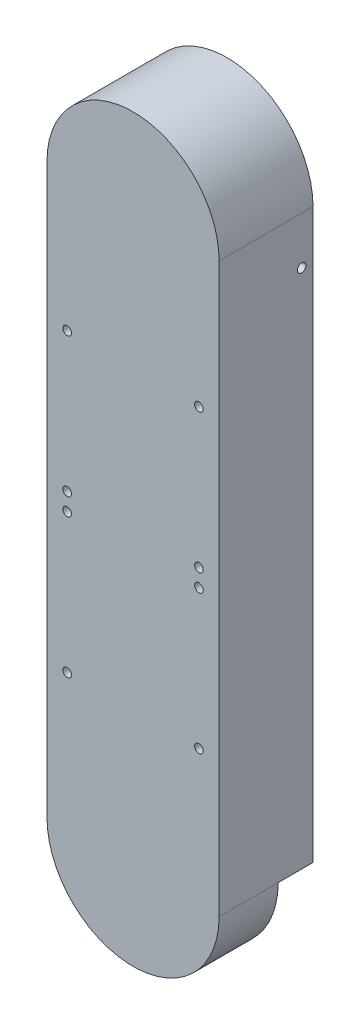
ISO-10303-21;
HEADER;
FILE_DESCRIPTION(('STEP AP214'),'2;1');
FILE_NAME('part.step','',(''),(''),'','','');
FILE_SCHEMA(('AUTOMOTIVE_DESIGN { 1 0 10303 214 1 1 1 1 }'));
ENDSEC;
DATA;
#1=APPLICATION_CONTEXT('core data for automotive mechanical design processes');
#2=APPLICATION_PROTOCOL_DEFINITION('international standard','automotive_design',2000,#1);
#3=PRODUCT_CONTEXT('',#1,'mechanical');
#4=PRODUCT('Part','Part','',(#3));
#5=PRODUCT_RELATED_PRODUCT_CATEGORY('part','',(#4));
#6=PRODUCT_DEFINITION_FORMATION('','',#4);
#7=PRODUCT_DEFINITION_CONTEXT('part definition',#1,'design');
#8=PRODUCT_DEFINITION('design','',#6,#7);
#9=PRODUCT_DEFINITION_SHAPE('','',#8);
#10=(LENGTH_UNIT() NAMED_UNIT(*) SI_UNIT(.MILLI.,.METRE.));
#11=(NAMED_UNIT(*) PLANE_ANGLE_UNIT() SI_UNIT($,.RADIAN.));
#12=(NAMED_UNIT(*) SI_UNIT($,.STERADIAN.) SOLID_ANGLE_UNIT());
#13=UNCERTAINTY_MEASURE_WITH_UNIT(LENGTH_MEASURE(1.E-05),#10,'distance_accuracy_value','');
#14=(GEOMETRIC_REPRESENTATION_CONTEXT(3) GLOBAL_UNCERTAINTY_ASSIGNED_CONTEXT((#13)) GLOBAL_UNIT_ASSIGNED_CONTEXT((#10,
#11,#12)) REPRESENTATION_CONTEXT('',''));
#15=CARTESIAN_POINT('',(0.,0.,0.));
#16=DIRECTION('',(0.,0.,1.));
#17=DIRECTION('',(1.,0.,0.));
#18=AXIS2_PLACEMENT_3D('',#15,#16,#17);
#19=CARTESIAN_POINT('',(35.,-230.98,14.18));
#20=DIRECTION('',(0.,1.,0.));
#21=DIRECTION('',(0.,0.,1.));
#22=AXIS2_PLACEMENT_3D('',#19,#20,#21);
#23=PLANE('',#22);
#24=DIRECTION('',(0.,0.,-1.));
#25=VECTOR('',#24,1.);
#26=CARTESIAN_POINT('',(25.,-230.98,105.710678118655));
#27=LINE('',#26,#25);
#28=CARTESIAN_POINT('',(25.,-230.98,35.));
#29=VERTEX_POINT('',#28);
#30=CARTESIAN_POINT('',(25.,-230.98,14.18));
#31=VERTEX_POINT('',#30);
#32=EDGE_CURVE('E49',#29,#31,#27,.T.);
#33=ORIENTED_EDGE('',*,*,#32,.F.);
#34=DIRECTION('',(1.,0.,0.));
#35=VECTOR('',#34,1.);
#36=CARTESIAN_POINT('',(-30.,-230.98,35.));
#37=LINE('',#36,#35);
#38=CARTESIAN_POINT('',(30.,-230.98,35.));
#39=VERTEX_POINT('',#38);
#40=EDGE_CURVE('E175',#29,#39,#37,.T.);
#41=ORIENTED_EDGE('',*,*,#40,.T.);
#42=DIRECTION('',(0.,0.,-1.));
#43=VECTOR('',#42,1.);
#44=CARTESIAN_POINT('',(30.,-230.98,35.));
#45=LINE('',#44,#43);
#46=CARTESIAN_POINT('',(30.,-230.98,14.18));
#47=VERTEX_POINT('',#46);
#48=EDGE_CURVE('E155',#39,#47,#45,.T.);
#49=ORIENTED_EDGE('',*,*,#48,.T.);
#50=DIRECTION('',(-1.,0.,0.));
#51=VECTOR('',#50,1.);
#52=CARTESIAN_POINT('',(35.,-230.98,14.18));
#53=LINE('',#52,#51);
#54=EDGE_CURVE('E136',#47,#31,#53,.T.);
#55=ORIENTED_EDGE('',*,*,#54,.T.);
#56=EDGE_LOOP('',(#33,#41,#49,#55));
#57=FACE_BOUND('',#56,.T.);
#58=ADVANCED_FACE('F34',(#57),#23,.T.);
#59=CARTESIAN_POINT('',(0.,-230.98,0.));
#60=DIRECTION('',(0.,-1.,0.));
#61=DIRECTION('',(0.,0.,-1.));
#62=AXIS2_PLACEMENT_3D('',#59,#60,#61);
#63=PLANE('',#62);
#64=DIRECTION('',(0.,0.,1.));
#65=VECTOR('',#64,1.);
#66=CARTESIAN_POINT('',(35.,-230.98,0.));
#67=LINE('',#66,#65);
#68=CARTESIAN_POINT('',(35.,-230.98,0.));
#69=VERTEX_POINT('',#68);
#70=CARTESIAN_POINT('',(35.,-230.98,14.18));
#71=VERTEX_POINT('',#70);
#72=EDGE_CURVE('E162',#69,#71,#67,.T.);
#73=ORIENTED_EDGE('',*,*,#72,.T.);
#74=EDGE_CURVE('E139',#71,#47,#53,.T.);
#75=ORIENTED_EDGE('',*,*,#74,.T.);
#76=CARTESIAN_POINT('',(30.,-230.98,0.));
#77=VERTEX_POINT('',#76);
#78=EDGE_CURVE('E150',#47,#77,#45,.T.);
#79=ORIENTED_EDGE('',*,*,#78,.T.);
#80=DIRECTION('',(1.,0.,0.));
#81=VECTOR('',#80,1.);
#82=CARTESIAN_POINT('',(30.,-230.98,0.));
#83=LINE('',#82,#81);
#84=EDGE_CURVE('E159',#77,#69,#83,.T.);
#85=ORIENTED_EDGE('',*,*,#84,.T.);
#86=EDGE_LOOP('',(#73,#75,#79,#85));
#87=FACE_BOUND('',#86,.T.);
#88=ADVANCED_FACE('F274',(#87),#63,.T.);
#89=DIRECTION('',(0.,0.,1.));
#90=VECTOR('',#89,1.);
#91=CARTESIAN_POINT('',(-30.,-230.98,0.));
#92=LINE('',#91,#90);
#93=CARTESIAN_POINT('',(-30.,-230.98,0.));
#94=VERTEX_POINT('',#93);
#95=CARTESIAN_POINT('',(-30.,-230.98,14.18));
#96=VERTEX_POINT('',#95);
#97=EDGE_CURVE('E172',#94,#96,#92,.T.);
#98=ORIENTED_EDGE('',*,*,#97,.T.);
#99=DIRECTION('',(-1.,0.,0.));
#100=VECTOR('',#99,1.);
#101=CARTESIAN_POINT('',(0.,-230.98,14.18));
#102=LINE('',#101,#100);
#103=CARTESIAN_POINT('',(-35.,-230.98,14.18));
#104=VERTEX_POINT('',#103);
#105=EDGE_CURVE('E42',#96,#104,#102,.T.);
#106=ORIENTED_EDGE('',*,*,#105,.T.);
#107=DIRECTION('',(0.,0.,-1.));
#108=VECTOR('',#107,1.);
#109=CARTESIAN_POINT('',(-35.,-230.98,38.18));
#110=LINE('',#109,#108);
#111=CARTESIAN_POINT('',(-35.,-230.98,0.));
#112=VERTEX_POINT('',#111);
#113=EDGE_CURVE('E164',#104,#112,#110,.T.);
#114=ORIENTED_EDGE('',*,*,#113,.T.);
#115=DIRECTION('',(1.,0.,0.));
#116=VECTOR('',#115,1.);
#117=CARTESIAN_POINT('',(-35.,-230.98,0.));
#118=LINE('',#117,#116);
#119=EDGE_CURVE('E168',#112,#94,#118,.T.);
#120=ORIENTED_EDGE('',*,*,#119,.T.);
#121=EDGE_LOOP('',(#98,#106,#114,#120));
#122=FACE_BOUND('',#121,.T.);
#123=ADVANCED_FACE('F259',(#122),#63,.T.);
#124=CARTESIAN_POINT('',(0.,0.,35.));
#125=DIRECTION('',(0.,0.,-1.));
#126=DIRECTION('',(-1.,0.,0.));
#127=AXIS2_PLACEMENT_3D('',#124,#125,#126);
#128=CYLINDRICAL_SURFACE('',#127,35.);
#129=CARTESIAN_POINT('',(0.,0.,0.));
#130=DIRECTION('',(0.,0.,1.));
#131=DIRECTION('',(1.,0.,0.));
#132=AXIS2_PLACEMENT_3D('',#129,#130,#131);
#133=CIRCLE('',#132,35.);
#134=CARTESIAN_POINT('',(35.,0.,0.));
#135=VERTEX_POINT('',#134);
#136=CARTESIAN_POINT('',(-35.,0.,0.));
#137=VERTEX_POINT('',#136);
#138=EDGE_CURVE('E222',#135,#137,#133,.T.);
#139=ORIENTED_EDGE('',*,*,#138,.T.);
#140=DIRECTION('',(0.,0.,-1.));
#141=VECTOR('',#140,1.);
#142=CARTESIAN_POINT('',(-35.,0.,35.));
#143=LINE('',#142,#141);
#144=CARTESIAN_POINT('',(-35.,0.,38.18));
#145=VERTEX_POINT('',#144);
#146=EDGE_CURVE('E255',#145,#137,#143,.T.);
#147=ORIENTED_EDGE('',*,*,#146,.F.);
#148=CARTESIAN_POINT('',(0.,0.,38.18));
#149=DIRECTION('',(0.,0.,1.));
#150=DIRECTION('',(1.,0.,0.));
#151=AXIS2_PLACEMENT_3D('',#148,#149,#150);
#152=CIRCLE('',#151,35.);
#153=CARTESIAN_POINT('',(35.,0.,38.18));
#154=VERTEX_POINT('',#153);
#155=EDGE_CURVE('E213',#154,#145,#152,.T.);
#156=ORIENTED_EDGE('',*,*,#155,.F.);
#157=DIRECTION('',(0.,0.,-1.));
#158=VECTOR('',#157,1.);
#159=CARTESIAN_POINT('',(35.,0.,35.));
#160=LINE('',#159,#158);
#161=EDGE_CURVE('E233',#154,#135,#160,.T.);
#162=ORIENTED_EDGE('',*,*,#161,.T.);
#163=EDGE_LOOP('',(#139,#147,#156,#162));
#164=FACE_BOUND('',#163,.T.);
#165=ADVANCED_FACE('F36',(#164),#128,.T.);
#166=CARTESIAN_POINT('',(-35.,0.,35.));
#167=DIRECTION('',(1.,0.,0.));
#168=DIRECTION('',(0.,1.,0.));
#169=AXIS2_PLACEMENT_3D('',#166,#167,#168);
#170=PLANE('',#169);
#171=CARTESIAN_POINT('',(-35.,-19.28,4.61));
#172=DIRECTION('',(1.,0.,0.));
#173=DIRECTION('',(0.,1.,0.));
#174=AXIS2_PLACEMENT_3D('',#171,#172,#173);
#175=CIRCLE('',#174,1.75);
#176=CARTESIAN_POINT('',(-35.,-17.53,4.61));
#177=VERTEX_POINT('',#176);
#178=EDGE_CURVE('E178',#177,#177,#175,.T.);
#179=ORIENTED_EDGE('',*,*,#178,.T.);
#180=EDGE_LOOP('',(#179));
#181=FACE_BOUND('',#180,.T.);
#182=DIRECTION('',(0.,-1.,0.));
#183=VECTOR('',#182,1.);
#184=CARTESIAN_POINT('',(-35.,0.,0.));
#185=LINE('',#184,#183);
#186=EDGE_CURVE('E236',#137,#112,#185,.T.);
#187=ORIENTED_EDGE('',*,*,#186,.T.);
#188=ORIENTED_EDGE('',*,*,#113,.F.);
#189=CARTESIAN_POINT('',(-35.,-230.98,38.18));
#190=VERTEX_POINT('',#189);
#191=EDGE_CURVE('E165',#190,#104,#110,.T.);
#192=ORIENTED_EDGE('',*,*,#191,.F.);
#193=DIRECTION('',(0.,-1.,0.));
#194=VECTOR('',#193,1.);
#195=CARTESIAN_POINT('',(-35.,0.,38.18));
#196=LINE('',#195,#194);
#197=EDGE_CURVE('E216',#145,#190,#196,.T.);
#198=ORIENTED_EDGE('',*,*,#197,.F.);
#199=ORIENTED_EDGE('',*,*,#146,.T.);
#200=EDGE_LOOP('',(#187,#188,#192,#198,#199));
#201=FACE_BOUND('',#200,.T.);
#202=ADVANCED_FACE('F262',(#181,#201),#170,.F.);
#203=CARTESIAN_POINT('',(-30.,0.,35.));
#204=DIRECTION('',(-1.,0.,0.));
#205=DIRECTION('',(0.,-1.,0.));
#206=AXIS2_PLACEMENT_3D('',#203,#204,#205);
#207=PLANE('',#206);
#208=CARTESIAN_POINT('',(-30.,-19.28,4.61));
#209=DIRECTION('',(-1.,0.,0.));
#210=DIRECTION('',(0.,-1.,0.));
#211=AXIS2_PLACEMENT_3D('',#208,#209,#210);
#212=CIRCLE('',#211,1.75);
#213=CARTESIAN_POINT('',(-30.,-21.03,4.61));
#214=VERTEX_POINT('',#213);
#215=EDGE_CURVE('E186',#214,#214,#212,.T.);
#216=ORIENTED_EDGE('',*,*,#215,.T.);
#217=EDGE_LOOP('',(#216));
#218=FACE_BOUND('',#217,.T.);
#219=DIRECTION('',(0.,1.,0.));
#220=VECTOR('',#219,1.);
#221=CARTESIAN_POINT('',(-30.,0.,0.));
#222=LINE('',#221,#220);
#223=CARTESIAN_POINT('',(-30.,0.,0.));
#224=VERTEX_POINT('',#223);
#225=EDGE_CURVE('E239',#94,#224,#222,.T.);
#226=ORIENTED_EDGE('',*,*,#225,.T.);
#227=DIRECTION('',(0.,0.,-1.));
#228=VECTOR('',#227,1.);
#229=CARTESIAN_POINT('',(-30.,0.,35.));
#230=LINE('',#229,#228);
#231=CARTESIAN_POINT('',(-30.,0.,35.));
#232=VERTEX_POINT('',#231);
#233=EDGE_CURVE('E252',#232,#224,#230,.T.);
#234=ORIENTED_EDGE('',*,*,#233,.F.);
#235=DIRECTION('',(0.,1.,0.));
#236=VECTOR('',#235,1.);
#237=CARTESIAN_POINT('',(-30.,0.,35.));
#238=LINE('',#237,#236);
#239=CARTESIAN_POINT('',(-30.,-230.98,35.));
#240=VERTEX_POINT('',#239);
#241=EDGE_CURVE('E223',#240,#232,#238,.T.);
#242=ORIENTED_EDGE('',*,*,#241,.F.);
#243=EDGE_CURVE('E171',#96,#240,#92,.T.);
#244=ORIENTED_EDGE('',*,*,#243,.F.);
#245=ORIENTED_EDGE('',*,*,#97,.F.);
#246=EDGE_LOOP('',(#226,#234,#242,#244,#245));
#247=FACE_BOUND('',#246,.T.);
#248=ADVANCED_FACE('F287',(#218,#247),#207,.F.);
#249=CARTESIAN_POINT('',(0.,0.,35.));
#250=DIRECTION('',(0.,0.,-1.));
#251=DIRECTION('',(-1.,0.,0.));
#252=AXIS2_PLACEMENT_3D('',#249,#250,#251);
#253=CYLINDRICAL_SURFACE('',#252,30.);
#254=CARTESIAN_POINT('',(0.,0.,0.));
#255=DIRECTION('',(0.,0.,-1.));
#256=DIRECTION('',(1.,0.,0.));
#257=AXIS2_PLACEMENT_3D('',#254,#255,#256);
#258=CIRCLE('',#257,30.);
#259=CARTESIAN_POINT('',(30.,0.,0.));
#260=VERTEX_POINT('',#259);
#261=EDGE_CURVE('E241',#224,#260,#258,.T.);
#262=ORIENTED_EDGE('',*,*,#261,.T.);
#263=DIRECTION('',(0.,0.,-1.));
#264=VECTOR('',#263,1.);
#265=CARTESIAN_POINT('',(30.,0.,35.));
#266=LINE('',#265,#264);
#267=CARTESIAN_POINT('',(30.,0.,35.));
#268=VERTEX_POINT('',#267);
#269=EDGE_CURVE('E249',#268,#260,#266,.T.);
#270=ORIENTED_EDGE('',*,*,#269,.F.);
#271=CARTESIAN_POINT('',(0.,0.,35.));
#272=DIRECTION('',(0.,0.,-1.));
#273=DIRECTION('',(1.,0.,0.));
#274=AXIS2_PLACEMENT_3D('',#271,#272,#273);
#275=CIRCLE('',#274,30.);
#276=EDGE_CURVE('E226',#232,#268,#275,.T.);
#277=ORIENTED_EDGE('',*,*,#276,.F.);
#278=ORIENTED_EDGE('',*,*,#233,.T.);
#279=EDGE_LOOP('',(#262,#270,#277,#278));
#280=FACE_BOUND('',#279,.T.);
#281=ADVANCED_FACE('F454',(#280),#253,.F.);
#282=CARTESIAN_POINT('',(30.,0.,35.));
#283=DIRECTION('',(1.,0.,0.));
#284=DIRECTION('',(0.,1.,0.));
#285=AXIS2_PLACEMENT_3D('',#282,#283,#284);
#286=PLANE('',#285);
#287=CARTESIAN_POINT('',(30.,-19.28,4.61));
#288=DIRECTION('',(1.,0.,0.));
#289=DIRECTION('',(0.,1.,0.));
#290=AXIS2_PLACEMENT_3D('',#287,#288,#289);
#291=CIRCLE('',#290,1.75);
#292=CARTESIAN_POINT('',(30.,-17.53,4.61));
#293=VERTEX_POINT('',#292);
#294=EDGE_CURVE('E181',#293,#293,#291,.T.);
#295=ORIENTED_EDGE('',*,*,#294,.T.);
#296=EDGE_LOOP('',(#295));
#297=FACE_BOUND('',#296,.T.);
#298=DIRECTION('',(0.,-1.,0.));
#299=VECTOR('',#298,1.);
#300=CARTESIAN_POINT('',(30.,0.,0.));
#301=LINE('',#300,#299);
#302=EDGE_CURVE('E243',#260,#77,#301,.T.);
#303=ORIENTED_EDGE('',*,*,#302,.T.);
#304=ORIENTED_EDGE('',*,*,#78,.F.);
#305=ORIENTED_EDGE('',*,*,#48,.F.);
#306=DIRECTION('',(0.,-1.,0.));
#307=VECTOR('',#306,1.);
#308=CARTESIAN_POINT('',(30.,0.,35.));
#309=LINE('',#308,#307);
#310=EDGE_CURVE('E230',#268,#39,#309,.T.);
#311=ORIENTED_EDGE('',*,*,#310,.F.);
#312=ORIENTED_EDGE('',*,*,#269,.T.);
#313=EDGE_LOOP('',(#303,#304,#305,#311,#312));
#314=FACE_BOUND('',#313,.T.);
#315=ADVANCED_FACE('F271',(#297,#314),#286,.F.);
#316=CARTESIAN_POINT('',(35.,0.,35.));
#317=DIRECTION('',(-1.,0.,0.));
#318=DIRECTION('',(0.,-1.,0.));
#319=AXIS2_PLACEMENT_3D('',#316,#317,#318);
#320=PLANE('',#319);
#321=CARTESIAN_POINT('',(35.,-19.28,4.61));
#322=DIRECTION('',(1.,0.,0.));
#323=DIRECTION('',(0.,1.,0.));
#324=AXIS2_PLACEMENT_3D('',#321,#322,#323);
#325=CIRCLE('',#324,1.75);
#326=CARTESIAN_POINT('',(35.,-17.53,4.61));
#327=VERTEX_POINT('',#326);
#328=EDGE_CURVE('E177',#327,#327,#325,.T.);
#329=ORIENTED_EDGE('',*,*,#328,.F.);
#330=EDGE_LOOP('',(#329));
#331=FACE_BOUND('',#330,.T.);
#332=DIRECTION('',(0.,1.,0.));
#333=VECTOR('',#332,1.);
#334=CARTESIAN_POINT('',(35.,0.,0.));
#335=LINE('',#334,#333);
#336=EDGE_CURVE('E227',#69,#135,#335,.T.);
#337=ORIENTED_EDGE('',*,*,#336,.T.);
#338=ORIENTED_EDGE('',*,*,#161,.F.);
#339=DIRECTION('',(0.,1.,0.));
#340=VECTOR('',#339,1.);
#341=CARTESIAN_POINT('',(35.,-115.49,38.18));
#342=LINE('',#341,#340);
#343=CARTESIAN_POINT('',(35.,-230.98,38.18));
#344=VERTEX_POINT('',#343);
#345=EDGE_CURVE('E219',#344,#154,#342,.T.);
#346=ORIENTED_EDGE('',*,*,#345,.F.);
#347=DIRECTION('',(0.,0.,1.));
#348=VECTOR('',#347,1.);
#349=CARTESIAN_POINT('',(35.,-230.98,14.18));
#350=LINE('',#349,#348);
#351=EDGE_CURVE('E144',#71,#344,#350,.T.);
#352=ORIENTED_EDGE('',*,*,#351,.F.);
#353=ORIENTED_EDGE('',*,*,#72,.F.);
#354=EDGE_LOOP('',(#337,#338,#346,#352,#353));
#355=FACE_BOUND('',#354,.T.);
#356=ADVANCED_FACE('F278',(#331,#355),#320,.F.);
#357=CARTESIAN_POINT('',(0.,0.,0.));
#358=DIRECTION('',(0.,0.,1.));
#359=DIRECTION('',(1.,0.,0.));
#360=AXIS2_PLACEMENT_3D('',#357,#358,#359);
#361=PLANE('',#360);
#362=ORIENTED_EDGE('',*,*,#138,.F.);
#363=ORIENTED_EDGE('',*,*,#336,.F.);
#364=ORIENTED_EDGE('',*,*,#84,.F.);
#365=ORIENTED_EDGE('',*,*,#302,.F.);
#366=ORIENTED_EDGE('',*,*,#261,.F.);
#367=ORIENTED_EDGE('',*,*,#225,.F.);
#368=ORIENTED_EDGE('',*,*,#119,.F.);
#369=ORIENTED_EDGE('',*,*,#186,.F.);
#370=EDGE_LOOP('',(#362,#363,#364,#365,#366,#367,#368,#369));
#371=FACE_BOUND('',#370,.T.);
#372=ADVANCED_FACE('F284',(#371),#361,.F.);
#373=CARTESIAN_POINT('',(0.,0.,35.));
#374=DIRECTION('',(0.,0.,1.));
#375=DIRECTION('',(1.,0.,0.));
#376=AXIS2_PLACEMENT_3D('',#373,#374,#375);
#377=PLANE('',#376);
#378=CARTESIAN_POINT('',(-26.795,-175.86,35.));
#379=DIRECTION('',(0.,0.,1.));
#380=DIRECTION('',(1.,0.,0.));
#381=AXIS2_PLACEMENT_3D('',#378,#379,#380);
#382=CIRCLE('',#381,1.75);
#383=CARTESIAN_POINT('',(-25.045,-175.86,35.));
#384=VERTEX_POINT('',#383);
#385=EDGE_CURVE('E304',#384,#384,#382,.T.);
#386=ORIENTED_EDGE('',*,*,#385,.T.);
#387=EDGE_LOOP('',(#386));
#388=FACE_BOUND('',#387,.T.);
#389=CARTESIAN_POINT('',(26.795,-175.86,35.));
#390=DIRECTION('',(0.,0.,1.));
#391=DIRECTION('',(1.,0.,0.));
#392=AXIS2_PLACEMENT_3D('',#389,#390,#391);
#393=CIRCLE('',#392,1.75);
#394=CARTESIAN_POINT('',(28.545,-175.86,35.));
#395=VERTEX_POINT('',#394);
#396=EDGE_CURVE('E309',#395,#395,#393,.T.);
#397=ORIENTED_EDGE('',*,*,#396,.T.);
#398=EDGE_LOOP('',(#397));
#399=FACE_BOUND('',#398,.T.);
#400=CARTESIAN_POINT('',(26.795,-119.23,35.));
#401=DIRECTION('',(0.,0.,1.));
#402=DIRECTION('',(1.,0.,0.));
#403=AXIS2_PLACEMENT_3D('',#400,#401,#402);
#404=CIRCLE('',#403,1.75);
#405=CARTESIAN_POINT('',(28.545,-119.23,35.));
#406=VERTEX_POINT('',#405);
#407=EDGE_CURVE('E291',#406,#406,#404,.T.);
#408=ORIENTED_EDGE('',*,*,#407,.T.);
#409=EDGE_LOOP('',(#408));
#410=FACE_BOUND('',#409,.T.);
#411=CARTESIAN_POINT('',(-26.795,-119.23,35.));
#412=DIRECTION('',(0.,0.,1.));
#413=DIRECTION('',(1.,0.,0.));
#414=AXIS2_PLACEMENT_3D('',#411,#412,#413);
#415=CIRCLE('',#414,1.75);
#416=CARTESIAN_POINT('',(-25.045,-119.23,35.));
#417=VERTEX_POINT('',#416);
#418=EDGE_CURVE('E294',#417,#417,#415,.T.);
#419=ORIENTED_EDGE('',*,*,#418,.T.);
#420=EDGE_LOOP('',(#419));
#421=FACE_BOUND('',#420,.T.);
#422=CARTESIAN_POINT('',(-26.795,-55.49,35.));
#423=DIRECTION('',(0.,0.,1.));
#424=DIRECTION('',(1.,0.,0.));
#425=AXIS2_PLACEMENT_3D('',#422,#423,#424);
#426=CIRCLE('',#425,1.75);
#427=CARTESIAN_POINT('',(-25.045,-55.49,35.));
#428=VERTEX_POINT('',#427);
#429=EDGE_CURVE('E198',#428,#428,#426,.T.);
#430=ORIENTED_EDGE('',*,*,#429,.T.);
#431=EDGE_LOOP('',(#430));
#432=FACE_BOUND('',#431,.T.);
#433=CARTESIAN_POINT('',(26.795,-55.49,35.));
#434=DIRECTION('',(0.,0.,1.));
#435=DIRECTION('',(1.,0.,0.));
#436=AXIS2_PLACEMENT_3D('',#433,#434,#435);
#437=CIRCLE('',#436,1.75);
#438=CARTESIAN_POINT('',(28.545,-55.49,35.));
#439=VERTEX_POINT('',#438);
#440=EDGE_CURVE('E193',#439,#439,#437,.T.);
#441=ORIENTED_EDGE('',*,*,#440,.T.);
#442=EDGE_LOOP('',(#441));
#443=FACE_BOUND('',#442,.T.);
#444=CARTESIAN_POINT('',(26.795,-112.09,35.));
#445=DIRECTION('',(0.,0.,1.));
#446=DIRECTION('',(1.,0.,0.));
#447=AXIS2_PLACEMENT_3D('',#444,#445,#446);
#448=CIRCLE('',#447,1.75);
#449=CARTESIAN_POINT('',(28.545,-112.09,35.));
#450=VERTEX_POINT('',#449);
#451=EDGE_CURVE('E210',#450,#450,#448,.T.);
#452=ORIENTED_EDGE('',*,*,#451,.T.);
#453=EDGE_LOOP('',(#452));
#454=FACE_BOUND('',#453,.T.);
#455=CARTESIAN_POINT('',(-26.795,-112.09,35.));
#456=DIRECTION('',(0.,0.,1.));
#457=DIRECTION('',(1.,0.,0.));
#458=AXIS2_PLACEMENT_3D('',#455,#456,#457);
#459=CIRCLE('',#458,1.75);
#460=CARTESIAN_POINT('',(-25.045,-112.09,35.));
#461=VERTEX_POINT('',#460);
#462=EDGE_CURVE('E205',#461,#461,#459,.T.);
#463=ORIENTED_EDGE('',*,*,#462,.T.);
#464=EDGE_LOOP('',(#463));
#465=FACE_BOUND('',#464,.T.);
#466=ORIENTED_EDGE('',*,*,#40,.F.);
#467=CARTESIAN_POINT('',(0.,-230.98,35.));
#468=DIRECTION('',(0.,0.,1.));
#469=DIRECTION('',(1.,0.,0.));
#470=AXIS2_PLACEMENT_3D('',#467,#468,#469);
#471=CIRCLE('',#470,25.);
#472=CARTESIAN_POINT('',(-25.,-230.98,35.));
#473=VERTEX_POINT('',#472);
#474=EDGE_CURVE('E131',#29,#473,#471,.F.);
#475=ORIENTED_EDGE('',*,*,#474,.T.);
#476=EDGE_CURVE('E130',#240,#473,#37,.T.);
#477=ORIENTED_EDGE('',*,*,#476,.F.);
#478=ORIENTED_EDGE('',*,*,#241,.T.);
#479=ORIENTED_EDGE('',*,*,#276,.T.);
#480=ORIENTED_EDGE('',*,*,#310,.T.);
#481=EDGE_LOOP('',(#466,#475,#477,#478,#479,#480));
#482=FACE_BOUND('',#481,.T.);
#483=ADVANCED_FACE('F290',(#388,#399,#410,#421,#432,#443,#454,#465,#482),#377,.F.);
#484=CARTESIAN_POINT('',(0.,0.,38.18));
#485=DIRECTION('',(0.,0.,1.));
#486=DIRECTION('',(1.,0.,0.));
#487=AXIS2_PLACEMENT_3D('',#484,#485,#486);
#488=PLANE('',#487);
#489=CARTESIAN_POINT('',(-26.795,-175.86,38.18));
#490=DIRECTION('',(0.,0.,1.));
#491=DIRECTION('',(1.,0.,0.));
#492=AXIS2_PLACEMENT_3D('',#489,#490,#491);
#493=CIRCLE('',#492,1.75);
#494=CARTESIAN_POINT('',(-25.045,-175.86,38.18));
#495=VERTEX_POINT('',#494);
#496=EDGE_CURVE('E312',#495,#495,#493,.T.);
#497=ORIENTED_EDGE('',*,*,#496,.F.);
#498=EDGE_LOOP('',(#497));
#499=FACE_BOUND('',#498,.T.);
#500=CARTESIAN_POINT('',(26.795,-175.86,38.18));
#501=DIRECTION('',(0.,0.,1.));
#502=DIRECTION('',(1.,0.,0.));
#503=AXIS2_PLACEMENT_3D('',#500,#501,#502);
#504=CIRCLE('',#503,1.75);
#505=CARTESIAN_POINT('',(28.545,-175.86,38.18));
#506=VERTEX_POINT('',#505);
#507=EDGE_CURVE('E313',#506,#506,#504,.T.);
#508=ORIENTED_EDGE('',*,*,#507,.F.);
#509=EDGE_LOOP('',(#508));
#510=FACE_BOUND('',#509,.T.);
#511=CARTESIAN_POINT('',(26.795,-119.23,38.18));
#512=DIRECTION('',(0.,0.,1.));
#513=DIRECTION('',(1.,0.,0.));
#514=AXIS2_PLACEMENT_3D('',#511,#512,#513);
#515=CIRCLE('',#514,1.75);
#516=CARTESIAN_POINT('',(28.545,-119.23,38.18));
#517=VERTEX_POINT('',#516);
#518=EDGE_CURVE('E300',#517,#517,#515,.T.);
#519=ORIENTED_EDGE('',*,*,#518,.F.);
#520=EDGE_LOOP('',(#519));
#521=FACE_BOUND('',#520,.T.);
#522=CARTESIAN_POINT('',(-26.795,-119.23,38.18));
#523=DIRECTION('',(0.,0.,1.));
#524=DIRECTION('',(1.,0.,0.));
#525=AXIS2_PLACEMENT_3D('',#522,#523,#524);
#526=CIRCLE('',#525,1.75);
#527=CARTESIAN_POINT('',(-25.045,-119.23,38.18));
#528=VERTEX_POINT('',#527);
#529=EDGE_CURVE('E301',#528,#528,#526,.T.);
#530=ORIENTED_EDGE('',*,*,#529,.F.);
#531=EDGE_LOOP('',(#530));
#532=FACE_BOUND('',#531,.T.);
#533=CARTESIAN_POINT('',(-26.795,-55.49,38.18));
#534=DIRECTION('',(0.,0.,-1.));
#535=DIRECTION('',(-1.,0.,0.));
#536=AXIS2_PLACEMENT_3D('',#533,#534,#535);
#537=CIRCLE('',#536,1.75);
#538=CARTESIAN_POINT('',(-28.545,-55.49,38.18));
#539=VERTEX_POINT('',#538);
#540=EDGE_CURVE('E190',#539,#539,#537,.T.);
#541=ORIENTED_EDGE('',*,*,#540,.T.);
#542=EDGE_LOOP('',(#541));
#543=FACE_BOUND('',#542,.T.);
#544=CARTESIAN_POINT('',(26.795,-55.49,38.18));
#545=DIRECTION('',(0.,0.,-1.));
#546=DIRECTION('',(-1.,0.,0.));
#547=AXIS2_PLACEMENT_3D('',#544,#545,#546);
#548=CIRCLE('',#547,1.75);
#549=CARTESIAN_POINT('',(25.045,-55.49,38.18));
#550=VERTEX_POINT('',#549);
#551=EDGE_CURVE('E189',#550,#550,#548,.T.);
#552=ORIENTED_EDGE('',*,*,#551,.T.);
#553=EDGE_LOOP('',(#552));
#554=FACE_BOUND('',#553,.T.);
#555=CARTESIAN_POINT('',(26.795,-112.09,38.18));
#556=DIRECTION('',(0.,0.,-1.));
#557=DIRECTION('',(-1.,0.,0.));
#558=AXIS2_PLACEMENT_3D('',#555,#556,#557);
#559=CIRCLE('',#558,1.75);
#560=CARTESIAN_POINT('',(25.045,-112.09,38.18));
#561=VERTEX_POINT('',#560);
#562=EDGE_CURVE('E202',#561,#561,#559,.T.);
#563=ORIENTED_EDGE('',*,*,#562,.T.);
#564=EDGE_LOOP('',(#563));
#565=FACE_BOUND('',#564,.T.);
#566=CARTESIAN_POINT('',(-26.795,-112.09,38.18));
#567=DIRECTION('',(0.,0.,-1.));
#568=DIRECTION('',(-1.,0.,0.));
#569=AXIS2_PLACEMENT_3D('',#566,#567,#568);
#570=CIRCLE('',#569,1.75);
#571=CARTESIAN_POINT('',(-28.545,-112.09,38.18));
#572=VERTEX_POINT('',#571);
#573=EDGE_CURVE('E201',#572,#572,#570,.T.);
#574=ORIENTED_EDGE('',*,*,#573,.T.);
#575=EDGE_LOOP('',(#574));
#576=FACE_BOUND('',#575,.T.);
#577=ORIENTED_EDGE('',*,*,#155,.T.);
#578=ORIENTED_EDGE('',*,*,#197,.T.);
#579=CARTESIAN_POINT('',(0.,-230.98,38.18));
#580=DIRECTION('',(0.,0.,1.));
#581=DIRECTION('',(1.,0.,0.));
#582=AXIS2_PLACEMENT_3D('',#579,#580,#581);
#583=CIRCLE('',#582,35.);
#584=EDGE_CURVE('E141',#190,#344,#583,.T.);
#585=ORIENTED_EDGE('',*,*,#584,.T.);
#586=ORIENTED_EDGE('',*,*,#345,.T.);
#587=EDGE_LOOP('',(#577,#578,#585,#586));
#588=FACE_BOUND('',#587,.T.);
#589=ADVANCED_FACE('F281',(#499,#510,#521,#532,#543,#554,#565,#576,#588),#488,.T.);
#590=CARTESIAN_POINT('',(-26.795,-112.09,38.18));
#591=DIRECTION('',(0.,0.,-1.));
#592=DIRECTION('',(-1.,0.,0.));
#593=AXIS2_PLACEMENT_3D('',#590,#591,#592);
#594=CYLINDRICAL_SURFACE('',#593,1.75);
#595=ORIENTED_EDGE('',*,*,#573,.F.);
#596=EDGE_LOOP('',(#595));
#597=FACE_BOUND('',#596,.T.);
#598=ORIENTED_EDGE('',*,*,#462,.F.);
#599=EDGE_LOOP('',(#598));
#600=FACE_BOUND('',#599,.T.);
#601=ADVANCED_FACE('F324',(#597,#600),#594,.F.);
#602=CARTESIAN_POINT('',(26.795,-112.09,38.18));
#603=DIRECTION('',(0.,0.,-1.));
#604=DIRECTION('',(-1.,0.,0.));
#605=AXIS2_PLACEMENT_3D('',#602,#603,#604);
#606=CYLINDRICAL_SURFACE('',#605,1.75);
#607=ORIENTED_EDGE('',*,*,#562,.F.);
#608=EDGE_LOOP('',(#607));
#609=FACE_BOUND('',#608,.T.);
#610=ORIENTED_EDGE('',*,*,#451,.F.);
#611=EDGE_LOOP('',(#610));
#612=FACE_BOUND('',#611,.T.);
#613=ADVANCED_FACE('F342',(#609,#612),#606,.F.);
#614=CARTESIAN_POINT('',(26.795,-55.49,38.18));
#615=DIRECTION('',(0.,0.,-1.));
#616=DIRECTION('',(-1.,0.,0.));
#617=AXIS2_PLACEMENT_3D('',#614,#615,#616);
#618=CYLINDRICAL_SURFACE('',#617,1.75);
#619=ORIENTED_EDGE('',*,*,#551,.F.);
#620=EDGE_LOOP('',(#619));
#621=FACE_BOUND('',#620,.T.);
#622=ORIENTED_EDGE('',*,*,#440,.F.);
#623=EDGE_LOOP('',(#622));
#624=FACE_BOUND('',#623,.T.);
#625=ADVANCED_FACE('F381',(#621,#624),#618,.F.);
#626=CARTESIAN_POINT('',(-26.795,-55.49,38.18));
#627=DIRECTION('',(0.,0.,-1.));
#628=DIRECTION('',(-1.,0.,0.));
#629=AXIS2_PLACEMENT_3D('',#626,#627,#628);
#630=CYLINDRICAL_SURFACE('',#629,1.75);
#631=ORIENTED_EDGE('',*,*,#540,.F.);
#632=EDGE_LOOP('',(#631));
#633=FACE_BOUND('',#632,.T.);
#634=ORIENTED_EDGE('',*,*,#429,.F.);
#635=EDGE_LOOP('',(#634));
#636=FACE_BOUND('',#635,.T.);
#637=ADVANCED_FACE('F374',(#633,#636),#630,.F.);
#638=CARTESIAN_POINT('',(-35.,-19.28,4.61));
#639=DIRECTION('',(1.,0.,0.));
#640=DIRECTION('',(0.,1.,0.));
#641=AXIS2_PLACEMENT_3D('',#638,#639,#640);
#642=CYLINDRICAL_SURFACE('',#641,1.75);
#643=ORIENTED_EDGE('',*,*,#328,.T.);
#644=EDGE_LOOP('',(#643));
#645=FACE_BOUND('',#644,.T.);
#646=ORIENTED_EDGE('',*,*,#294,.F.);
#647=EDGE_LOOP('',(#646));
#648=FACE_BOUND('',#647,.T.);
#649=ADVANCED_FACE('F368',(#645,#648),#642,.F.);
#650=ORIENTED_EDGE('',*,*,#178,.F.);
#651=EDGE_LOOP('',(#650));
#652=FACE_BOUND('',#651,.T.);
#653=ORIENTED_EDGE('',*,*,#215,.F.);
#654=EDGE_LOOP('',(#653));
#655=FACE_BOUND('',#654,.T.);
#656=ADVANCED_FACE('F363',(#652,#655),#642,.F.);
#657=DIRECTION('',(0.,0.,-1.));
#658=VECTOR('',#657,1.);
#659=CARTESIAN_POINT('',(-25.,-230.98,105.710678118655));
#660=LINE('',#659,#658);
#661=CARTESIAN_POINT('',(-25.,-230.98,14.18));
#662=VERTEX_POINT('',#661);
#663=EDGE_CURVE('E122',#662,#473,#660,.F.);
#664=ORIENTED_EDGE('',*,*,#663,.F.);
#665=EDGE_CURVE('E56',#662,#96,#53,.T.);
#666=ORIENTED_EDGE('',*,*,#665,.T.);
#667=ORIENTED_EDGE('',*,*,#243,.T.);
#668=ORIENTED_EDGE('',*,*,#476,.T.);
#669=EDGE_LOOP('',(#664,#666,#667,#668));
#670=FACE_BOUND('',#669,.T.);
#671=ADVANCED_FACE('F128',(#670),#23,.T.);
#672=CARTESIAN_POINT('',(0.,-230.98,14.18));
#673=DIRECTION('',(0.,0.,1.));
#674=DIRECTION('',(1.,0.,0.));
#675=AXIS2_PLACEMENT_3D('',#672,#673,#674);
#676=CYLINDRICAL_SURFACE('',#675,35.);
#677=ORIENTED_EDGE('',*,*,#584,.F.);
#678=ORIENTED_EDGE('',*,*,#191,.T.);
#679=CARTESIAN_POINT('',(0.,-230.98,14.18));
#680=DIRECTION('',(0.,0.,1.));
#681=DIRECTION('',(1.,0.,0.));
#682=AXIS2_PLACEMENT_3D('',#679,#680,#681);
#683=CIRCLE('',#682,35.);
#684=EDGE_CURVE('E137',#104,#71,#683,.T.);
#685=ORIENTED_EDGE('',*,*,#684,.T.);
#686=ORIENTED_EDGE('',*,*,#351,.T.);
#687=EDGE_LOOP('',(#677,#678,#685,#686));
#688=FACE_BOUND('',#687,.T.);
#689=ADVANCED_FACE('F265',(#688),#676,.T.);
#690=CARTESIAN_POINT('',(0.,-230.98,14.18));
#691=DIRECTION('',(0.,0.,1.));
#692=DIRECTION('',(1.,0.,0.));
#693=AXIS2_PLACEMENT_3D('',#690,#691,#692);
#694=PLANE('',#693);
#695=ORIENTED_EDGE('',*,*,#665,.F.);
#696=CARTESIAN_POINT('',(0.,-230.98,14.18));
#697=DIRECTION('',(0.,0.,1.));
#698=DIRECTION('',(1.,0.,0.));
#699=AXIS2_PLACEMENT_3D('',#696,#697,#698);
#700=CIRCLE('',#699,25.);
#701=EDGE_CURVE('E11',#662,#31,#700,.T.);
#702=ORIENTED_EDGE('',*,*,#701,.T.);
#703=ORIENTED_EDGE('',*,*,#54,.F.);
#704=ORIENTED_EDGE('',*,*,#74,.F.);
#705=ORIENTED_EDGE('',*,*,#684,.F.);
#706=ORIENTED_EDGE('',*,*,#105,.F.);
#707=EDGE_LOOP('',(#695,#702,#703,#704,#705,#706));
#708=FACE_BOUND('',#707,.T.);
#709=ADVANCED_FACE('F134',(#708),#694,.F.);
#710=CARTESIAN_POINT('',(0.,-230.98,105.710678118655));
#711=DIRECTION('',(0.,0.,-1.));
#712=DIRECTION('',(-1.,0.,0.));
#713=AXIS2_PLACEMENT_3D('',#710,#711,#712);
#714=CYLINDRICAL_SURFACE('',#713,25.);
#715=ORIENTED_EDGE('',*,*,#32,.T.);
#716=ORIENTED_EDGE('',*,*,#701,.F.);
#717=ORIENTED_EDGE('',*,*,#663,.T.);
#718=ORIENTED_EDGE('',*,*,#474,.F.);
#719=EDGE_LOOP('',(#715,#716,#717,#718));
#720=FACE_BOUND('',#719,.T.);
#721=ADVANCED_FACE('F121',(#720),#714,.F.);
#722=CARTESIAN_POINT('',(-26.795,-119.23,0.));
#723=DIRECTION('',(0.,0.,1.));
#724=DIRECTION('',(1.,0.,0.));
#725=AXIS2_PLACEMENT_3D('',#722,#723,#724);
#726=CYLINDRICAL_SURFACE('',#725,1.75);
#727=ORIENTED_EDGE('',*,*,#529,.T.);
#728=EDGE_LOOP('',(#727));
#729=FACE_BOUND('',#728,.T.);
#730=ORIENTED_EDGE('',*,*,#418,.F.);
#731=EDGE_LOOP('',(#730));
#732=FACE_BOUND('',#731,.T.);
#733=ADVANCED_FACE('F507',(#729,#732),#726,.F.);
#734=CARTESIAN_POINT('',(26.795,-119.23,0.));
#735=DIRECTION('',(0.,0.,1.));
#736=DIRECTION('',(1.,0.,0.));
#737=AXIS2_PLACEMENT_3D('',#734,#735,#736);
#738=CYLINDRICAL_SURFACE('',#737,1.75);
#739=ORIENTED_EDGE('',*,*,#518,.T.);
#740=EDGE_LOOP('',(#739));
#741=FACE_BOUND('',#740,.T.);
#742=ORIENTED_EDGE('',*,*,#407,.F.);
#743=EDGE_LOOP('',(#742));
#744=FACE_BOUND('',#743,.T.);
#745=ADVANCED_FACE('F516',(#741,#744),#738,.F.);
#746=CARTESIAN_POINT('',(26.795,-175.86,14.18));
#747=DIRECTION('',(0.,0.,1.));
#748=DIRECTION('',(1.,0.,0.));
#749=AXIS2_PLACEMENT_3D('',#746,#747,#748);
#750=CYLINDRICAL_SURFACE('',#749,1.75);
#751=ORIENTED_EDGE('',*,*,#507,.T.);
#752=EDGE_LOOP('',(#751));
#753=FACE_BOUND('',#752,.T.);
#754=ORIENTED_EDGE('',*,*,#396,.F.);
#755=EDGE_LOOP('',(#754));
#756=FACE_BOUND('',#755,.T.);
#757=ADVANCED_FACE('F525',(#753,#756),#750,.F.);
#758=CARTESIAN_POINT('',(-26.795,-175.86,14.18));
#759=DIRECTION('',(0.,0.,1.));
#760=DIRECTION('',(1.,0.,0.));
#761=AXIS2_PLACEMENT_3D('',#758,#759,#760);
#762=CYLINDRICAL_SURFACE('',#761,1.75);
#763=ORIENTED_EDGE('',*,*,#496,.T.);
#764=EDGE_LOOP('',(#763));
#765=FACE_BOUND('',#764,.T.);
#766=ORIENTED_EDGE('',*,*,#385,.F.);
#767=EDGE_LOOP('',(#766));
#768=FACE_BOUND('',#767,.T.);
#769=ADVANCED_FACE('F319',(#765,#768),#762,.F.);
#770=CLOSED_SHELL('',(#58,#88,#123,#165,#202,#248,#281,#315,#356,#372,#483,#589,#601,#613,#625,
#637,#649,#656,#671,#689,#709,#721,#733,#745,#757,#769));
#771=MANIFOLD_SOLID_BREP('B2',#770);
#772=ADVANCED_BREP_SHAPE_REPRESENTATION('',(#18,#771),#14);
#773=SHAPE_DEFINITION_REPRESENTATION(#9,#772);
ENDSEC;
END-ISO-10303-21;
